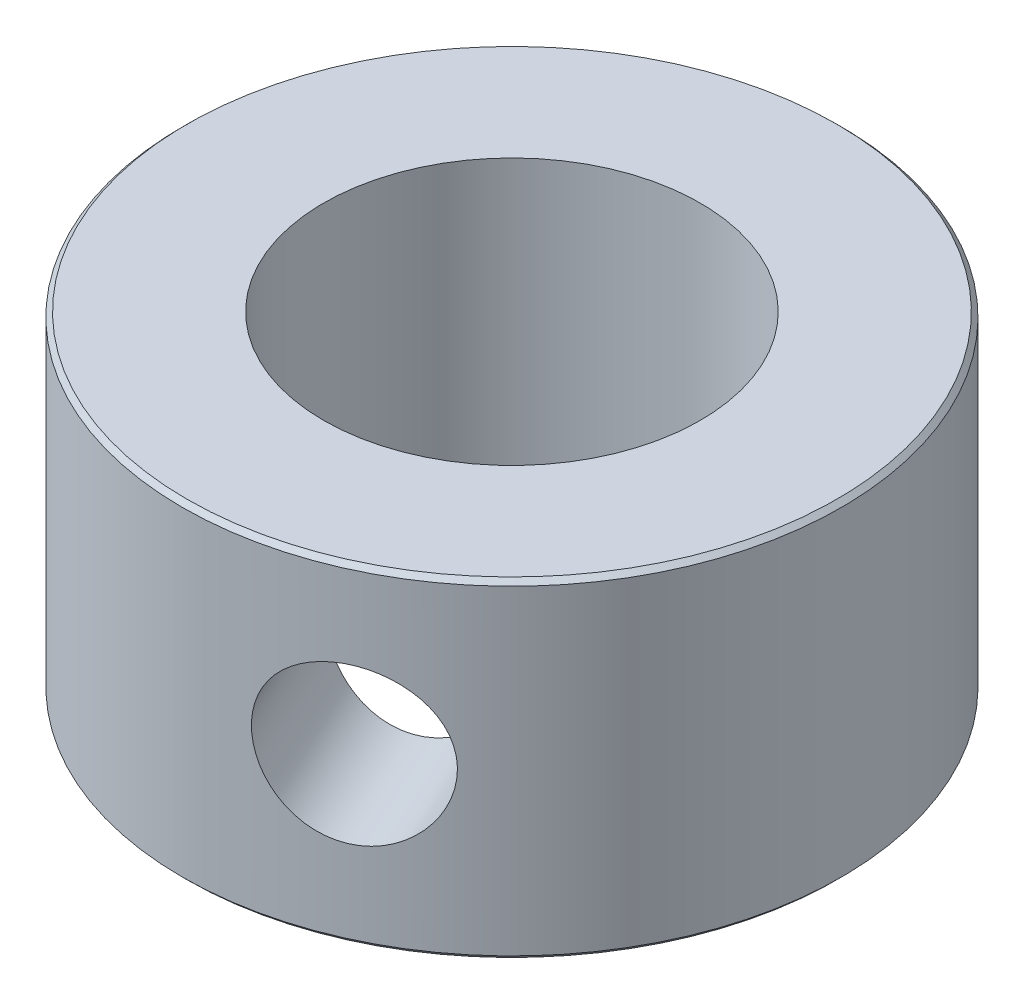
ISO-10303-21;
HEADER;
FILE_DESCRIPTION(('STEP AP214'),'2;1');
FILE_NAME('part.step','',(''),(''),'','','');
FILE_SCHEMA(('AUTOMOTIVE_DESIGN { 1 0 10303 214 1 1 1 1 }'));
ENDSEC;
DATA;
#1=APPLICATION_CONTEXT('core data for automotive mechanical design processes');
#2=APPLICATION_PROTOCOL_DEFINITION('international standard','automotive_design',2000,#1);
#3=PRODUCT_CONTEXT('',#1,'mechanical');
#4=PRODUCT('Part','Part','',(#3));
#5=PRODUCT_RELATED_PRODUCT_CATEGORY('part','',(#4));
#6=PRODUCT_DEFINITION_FORMATION('','',#4);
#7=PRODUCT_DEFINITION_CONTEXT('part definition',#1,'design');
#8=PRODUCT_DEFINITION('design','',#6,#7);
#9=PRODUCT_DEFINITION_SHAPE('','',#8);
#10=(LENGTH_UNIT() NAMED_UNIT(*) SI_UNIT(.MILLI.,.METRE.));
#11=(NAMED_UNIT(*) PLANE_ANGLE_UNIT() SI_UNIT($,.RADIAN.));
#12=(NAMED_UNIT(*) SI_UNIT($,.STERADIAN.) SOLID_ANGLE_UNIT());
#13=UNCERTAINTY_MEASURE_WITH_UNIT(LENGTH_MEASURE(1.E-05),#10,'distance_accuracy_value','');
#14=(GEOMETRIC_REPRESENTATION_CONTEXT(3) GLOBAL_UNCERTAINTY_ASSIGNED_CONTEXT((#13)) GLOBAL_UNIT_ASSIGNED_CONTEXT((#10,
#11,#12)) REPRESENTATION_CONTEXT('',''));
#15=CARTESIAN_POINT('',(0.,0.,0.));
#16=DIRECTION('',(0.,0.,1.));
#17=DIRECTION('',(1.,0.,0.));
#18=AXIS2_PLACEMENT_3D('',#15,#16,#17);
#19=CARTESIAN_POINT('',(0.,7.,0.));
#20=DIRECTION('',(0.,1.,0.));
#21=DIRECTION('',(0.,0.,1.));
#22=AXIS2_PLACEMENT_3D('',#19,#20,#21);
#23=PLANE('',#22);
#24=CARTESIAN_POINT('',(0.,7.,0.));
#25=DIRECTION('',(0.,1.,0.));
#26=DIRECTION('',(0.,0.,1.));
#27=AXIS2_PLACEMENT_3D('',#24,#25,#26);
#28=CIRCLE('',#27,6.9);
#29=CARTESIAN_POINT('',(0.,7.,6.9));
#30=VERTEX_POINT('',#29);
#31=EDGE_CURVE('E10',#30,#30,#28,.T.);
#32=ORIENTED_EDGE('',*,*,#31,.T.);
#33=EDGE_LOOP('',(#32));
#34=FACE_BOUND('',#33,.T.);
#35=CARTESIAN_POINT('',(0.,7.,0.));
#36=DIRECTION('',(0.,1.,0.));
#37=DIRECTION('',(0.,0.,1.));
#38=AXIS2_PLACEMENT_3D('',#35,#36,#37);
#39=CIRCLE('',#38,4.);
#40=CARTESIAN_POINT('',(0.,7.,4.));
#41=VERTEX_POINT('',#40);
#42=EDGE_CURVE('E78',#41,#41,#39,.T.);
#43=ORIENTED_EDGE('',*,*,#42,.F.);
#44=EDGE_LOOP('',(#43));
#45=FACE_BOUND('',#44,.T.);
#46=ADVANCED_FACE('F45',(#34,#45),#23,.T.);
#47=CARTESIAN_POINT('',(0.,0.,0.));
#48=DIRECTION('',(0.,1.,0.));
#49=DIRECTION('',(0.,0.,1.));
#50=AXIS2_PLACEMENT_3D('',#47,#48,#49);
#51=PLANE('',#50);
#52=CARTESIAN_POINT('',(0.,0.,0.));
#53=DIRECTION('',(0.,1.,0.));
#54=DIRECTION('',(0.,0.,1.));
#55=AXIS2_PLACEMENT_3D('',#52,#53,#54);
#56=CIRCLE('',#55,6.9);
#57=CARTESIAN_POINT('',(0.,0.,6.9));
#58=VERTEX_POINT('',#57);
#59=EDGE_CURVE('E53',#58,#58,#56,.F.);
#60=ORIENTED_EDGE('',*,*,#59,.T.);
#61=EDGE_LOOP('',(#60));
#62=FACE_BOUND('',#61,.T.);
#63=CARTESIAN_POINT('',(0.,0.,0.));
#64=DIRECTION('',(0.,1.,0.));
#65=DIRECTION('',(0.,0.,1.));
#66=AXIS2_PLACEMENT_3D('',#63,#64,#65);
#67=CIRCLE('',#66,4.);
#68=CARTESIAN_POINT('',(0.,0.,4.));
#69=VERTEX_POINT('',#68);
#70=EDGE_CURVE('E79',#69,#69,#67,.T.);
#71=ORIENTED_EDGE('',*,*,#70,.T.);
#72=EDGE_LOOP('',(#71));
#73=FACE_BOUND('',#72,.T.);
#74=ADVANCED_FACE('F109',(#62,#73),#51,.F.);
#75=CARTESIAN_POINT('',(0.,7.,0.));
#76=DIRECTION('',(0.,-1.,0.));
#77=DIRECTION('',(0.,0.,-1.));
#78=AXIS2_PLACEMENT_3D('',#75,#76,#77);
#79=CYLINDRICAL_SURFACE('',#78,7.);
#80=CARTESIAN_POINT('',(0.,0.1,0.));
#81=DIRECTION('',(0.,1.,0.));
#82=DIRECTION('',(0.,0.,1.));
#83=AXIS2_PLACEMENT_3D('',#80,#81,#82);
#84=CIRCLE('',#83,7.);
#85=CARTESIAN_POINT('',(0.,0.1,7.));
#86=VERTEX_POINT('',#85);
#87=EDGE_CURVE('E58',#86,#86,#84,.T.);
#88=ORIENTED_EDGE('',*,*,#87,.T.);
#89=EDGE_LOOP('',(#88));
#90=FACE_BOUND('',#89,.T.);
#91=CARTESIAN_POINT('',(0.,6.9,0.));
#92=DIRECTION('',(0.,1.,0.));
#93=DIRECTION('',(0.,0.,1.));
#94=AXIS2_PLACEMENT_3D('',#91,#92,#93);
#95=CIRCLE('',#94,7.);
#96=CARTESIAN_POINT('',(0.,6.9,7.));
#97=VERTEX_POINT('',#96);
#98=EDGE_CURVE('E63',#97,#97,#95,.F.);
#99=ORIENTED_EDGE('',*,*,#98,.T.);
#100=EDGE_LOOP('',(#99));
#101=FACE_BOUND('',#100,.T.);
#102=CARTESIAN_POINT('',(4.33695475854196,3.5,5.49461767754229));
#103=CARTESIAN_POINT('',(4.33695290809923,3.40871099997652,5.49462052617283));
#104=CARTESIAN_POINT('',(4.3308204478108,3.31738900161891,5.49947661884195));
#105=CARTESIAN_POINT('',(4.30642007110906,3.13735543656597,5.51860289653467));
#106=CARTESIAN_POINT('',(4.28814428934161,3.04864560071145,5.53287918307316));
#107=CARTESIAN_POINT('',(4.23988238827224,2.87646648747663,5.56994752920899));
#108=CARTESIAN_POINT('',(4.20991030824941,2.79299106604051,5.5927293780118));
#109=CARTESIAN_POINT('',(4.13886227276357,2.63338346720996,5.6455087575473));
#110=CARTESIAN_POINT('',(4.09778617216883,2.55725138581207,5.67550638259104));
#111=CARTESIAN_POINT('',(4.00448567264662,2.41300017131406,5.74172584098752));
#112=CARTESIAN_POINT('',(3.95207750988321,2.34504595472282,5.77804807616412));
#113=CARTESIAN_POINT('',(3.83756477380056,2.22052828829884,5.85472773588049));
#114=CARTESIAN_POINT('',(3.77545936948574,2.16396581562249,5.8950855061348));
#115=CARTESIAN_POINT('',(3.64198656861028,2.06317303018274,5.97847741494681));
#116=CARTESIAN_POINT('',(3.57051454492172,2.01910313876716,6.02153838899059));
#117=CARTESIAN_POINT('',(3.42057086009637,1.94558709172224,6.10795974013822));
#118=CARTESIAN_POINT('',(3.34210011561603,1.91613902430984,6.1513200773487));
#119=CARTESIAN_POINT('',(3.18166938286995,1.87322629782889,6.2357875098592));
#120=CARTESIAN_POINT('',(3.09979824945055,1.85948200603305,6.27692118266486));
#121=CARTESIAN_POINT('',(2.93356847400079,1.84749086323874,6.35630825329692));
#122=CARTESIAN_POINT('',(2.84921016192308,1.84924196573697,6.39456203080304));
#123=CARTESIAN_POINT('',(2.68219217534081,1.86798740501017,6.46637071990166));
#124=CARTESIAN_POINT('',(2.59953184601341,1.88468011500454,6.50000348980106));
#125=CARTESIAN_POINT('',(2.4366723032739,1.93235207443574,6.56279283289124));
#126=CARTESIAN_POINT('',(2.35647321238835,1.96333203390087,6.59194918352302));
#127=CARTESIAN_POINT('',(2.20026957556281,2.03895377039328,6.6457279442721));
#128=CARTESIAN_POINT('',(2.12430510224419,2.08370617046967,6.67031095667816));
#129=CARTESIAN_POINT('',(1.97956239020466,2.185519225885,6.71469078440217));
#130=CARTESIAN_POINT('',(1.91078527806698,2.24258180650105,6.73448685002701));
#131=CARTESIAN_POINT('',(1.7809711301695,2.36902452509401,6.76999157550689));
#132=CARTESIAN_POINT('',(1.72016071769164,2.43866849569449,6.78559016682727));
#133=CARTESIAN_POINT('',(1.61032671076822,2.5874443211498,6.81249254702226));
#134=CARTESIAN_POINT('',(1.56130354929443,2.66657652436841,6.82379617814235));
#135=CARTESIAN_POINT('',(1.47666330208507,2.83253525980706,6.84261364703833));
#136=CARTESIAN_POINT('',(1.44109924109201,2.91939059395085,6.85011253398433));
#137=CARTESIAN_POINT('',(1.38508822355287,3.09806127756916,6.86165848349057));
#138=CARTESIAN_POINT('',(1.36463843423409,3.18987569413077,6.86570619290513));
#139=CARTESIAN_POINT('',(1.34002741741275,3.37353855694924,6.87055176369806));
#140=CARTESIAN_POINT('',(1.33549350857823,3.46533515973006,6.87142399940529));
#141=CARTESIAN_POINT('',(1.34186731452449,3.64836457658374,6.87018213154625));
#142=CARTESIAN_POINT('',(1.35277378107572,3.73959743563189,6.86806826938189));
#143=CARTESIAN_POINT('',(1.38929825352498,3.91757745074746,6.86077149304204));
#144=CARTESIAN_POINT('',(1.41470564674566,4.00436984565374,6.85563248349688));
#145=CARTESIAN_POINT('',(1.47907488594476,4.17249368663451,6.8420328006842));
#146=CARTESIAN_POINT('',(1.51803819629995,4.25382454159378,6.83357176854278));
#147=CARTESIAN_POINT('',(1.6089117198084,4.41029905658938,6.81275318003319));
#148=CARTESIAN_POINT('',(1.66103829699158,4.48530818474253,6.80032948918988));
#149=CARTESIAN_POINT('',(1.7760975232139,4.62557800629822,6.7711883829357));
#150=CARTESIAN_POINT('',(1.8390317422003,4.69083728083161,6.75447034354099));
#151=CARTESIAN_POINT('',(1.97518588680678,4.81122298204254,6.71593224186882));
#152=CARTESIAN_POINT('',(2.04860137475439,4.86609535547159,6.69400817940542));
#153=CARTESIAN_POINT('',(2.20227224150703,4.9623180167779,6.64503502097462));
#154=CARTESIAN_POINT('',(2.2825272771498,5.00366898256504,6.61798618205064));
#155=CARTESIAN_POINT('',(2.4467542621969,5.0713378389333,6.55903535520843));
#156=CARTESIAN_POINT('',(2.53069634784018,5.0977586745676,6.52716857053034));
#157=CARTESIAN_POINT('',(2.70016326638837,5.13513286894145,6.45890503545275));
#158=CARTESIAN_POINT('',(2.7856878272703,5.14608886147333,6.42250905756199));
#159=CARTESIAN_POINT('',(2.95361249294322,5.15208813057132,6.34700294170077));
#160=CARTESIAN_POINT('',(3.03603823759707,5.14750832426095,6.30797929141249));
#161=CARTESIAN_POINT('',(3.19753347433021,5.12341975270526,6.22767321304482));
#162=CARTESIAN_POINT('',(3.27660304663566,5.10391134452658,6.18639083901215));
#163=CARTESIAN_POINT('',(3.42899022222941,5.05071176108927,6.10323970829406));
#164=CARTESIAN_POINT('',(3.50233107509893,5.01708187051131,6.06137423230331));
#165=CARTESIAN_POINT('',(3.64194798969843,4.9366509910792,5.97852928259634));
#166=CARTESIAN_POINT('',(3.7082232512061,4.88984851252764,5.93754990965491));
#167=CARTESIAN_POINT('',(3.83368684312346,4.78321390355334,5.85734707854002));
#168=CARTESIAN_POINT('',(3.89269059682572,4.72312153020512,5.81818087222184));
#169=CARTESIAN_POINT('',(4.000747446629,4.59212760248887,5.74441554290829));
#170=CARTESIAN_POINT('',(4.04979808207846,4.52122338274089,5.70981755002243));
#171=CARTESIAN_POINT('',(4.13770229302743,4.36924540614473,5.64645114230857));
#172=CARTESIAN_POINT('',(4.17637911535602,4.2880263885213,5.61778547287829));
#173=CARTESIAN_POINT('',(4.2416620994615,4.11860266624687,5.56866088592655));
#174=CARTESIAN_POINT('',(4.26827773329602,4.03040350750556,5.54819552989044));
#175=CARTESIAN_POINT('',(4.30463016708739,3.86853084559052,5.52001492462501));
#176=CARTESIAN_POINT('',(4.31673458241366,3.79568399515568,5.5105270007543));
#177=CARTESIAN_POINT('',(4.3328973646978,3.64856531846772,5.49782742587969));
#178=CARTESIAN_POINT('',(4.33695626448493,3.57429358690895,5.49461535924566));
#179=CARTESIAN_POINT('',(4.33695475854196,3.5,5.49461767754229));
#180=B_SPLINE_CURVE_WITH_KNOTS('',3,(#102,#103,#104,#105,#106,#107,#108,#109,#110,#111,#112,
#113,#114,#115,#116,#117,#118,#119,#120,#121,#122,#123,#124,#125,#126,#127,#128,#129,#130,#131,
#132,#133,#134,#135,#136,#137,#138,#139,#140,#141,#142,#143,#144,#145,#146,#147,#148,#149,#150,
#151,#152,#153,#154,#155,#156,#157,#158,#159,#160,#161,#162,#163,#164,#165,#166,#167,#168,#169,
#170,#171,#172,#173,#174,#175,#176,#177,#178,#179),.UNSPECIFIED.,.T.,.F.,(4,2,2,2,2,2,2,2,2,2,2,
2,2,2,2,2,2,2,2,2,2,2,2,2,2,2,2,2,2,2,2,2,2,2,2,2,2,2,4),(0.,0.273594440399257,
0.547366263700772,0.820810479503742,1.0942582694491,1.37252656286892,1.65081871531697,
1.93253747960749,2.21421939985747,2.49080324523181,2.76735056224875,3.03843805884696,
3.30953902903523,3.58287702808519,3.85625780745002,4.13623055025585,4.41621357550837,
4.69728844125183,4.97831061353601,5.25270687968442,5.52708096437944,5.79756789407087,
6.06808405216621,6.34337456664895,6.61870510445456,6.90008328124661,7.18144734868651,
7.46084693391314,7.74019892930649,8.0128224633276,8.28543947686363,8.55688541369865,
8.82836206089263,9.10571835709366,9.38314313916055,9.66503130549492,9.94669771026967,
10.1693714016501,10.3920303455577),.UNSPECIFIED.);
#181=CARTESIAN_POINT('',(4.33695475854196,3.5,5.49461767754229));
#182=VERTEX_POINT('',#181);
#183=EDGE_CURVE('E69',#182,#182,#180,.T.);
#184=ORIENTED_EDGE('',*,*,#183,.T.);
#185=EDGE_LOOP('',(#184));
#186=FACE_BOUND('',#185,.T.);
#187=ADVANCED_FACE('F81',(#90,#101,#186),#79,.T.);
#188=CARTESIAN_POINT('',(0.,7.,0.));
#189=DIRECTION('',(0.,-1.,0.));
#190=DIRECTION('',(0.,0.,-1.));
#191=AXIS2_PLACEMENT_3D('',#188,#189,#190);
#192=CYLINDRICAL_SURFACE('',#191,4.);
#193=CARTESIAN_POINT('',(3.01941624706044,3.5,2.62357114006605));
#194=CARTESIAN_POINT('',(3.01941144958077,3.41190351977432,2.62358329970489));
#195=CARTESIAN_POINT('',(3.01431509514671,3.32365956802641,2.62947842448701));
#196=CARTESIAN_POINT('',(2.99400573734745,3.14971293892112,2.65257427169993));
#197=CARTESIAN_POINT('',(2.97876501178491,3.0640178994024,2.66980597284604));
#198=CARTESIAN_POINT('',(2.93851283218737,2.89799706186937,2.71404237086341));
#199=CARTESIAN_POINT('',(2.91354065893688,2.8176511797814,2.74100774611007));
#200=CARTESIAN_POINT('',(2.8541662469186,2.66381823316578,2.80277769895583));
#201=CARTESIAN_POINT('',(2.81976636963666,2.59032945721597,2.83758031306585));
#202=CARTESIAN_POINT('',(2.73968469007096,2.4477713121535,2.91502885177799));
#203=CARTESIAN_POINT('',(2.69348439036254,2.3791707442198,2.95800197769271));
#204=CARTESIAN_POINT('',(2.59129959116768,2.25264522809124,3.04791662533316));
#205=CARTESIAN_POINT('',(2.53531137854823,2.19472434852778,3.09485964957403));
#206=CARTESIAN_POINT('',(2.41153898349142,2.08882862869814,3.19232424498335));
#207=CARTESIAN_POINT('',(2.34335557156882,2.04137906729385,3.24291316937387));
#208=CARTESIAN_POINT('',(2.19809677930497,1.9613298546783,3.3430727523345));
#209=CARTESIAN_POINT('',(2.12102529019716,1.92872373565344,3.39264384540126));
#210=CARTESIAN_POINT('',(1.96395594854863,1.88097929334378,3.4857972032843));
#211=CARTESIAN_POINT('',(1.88430915443039,1.86503315207677,3.52955607983508));
#212=CARTESIAN_POINT('',(1.72092940034066,1.84845334814483,3.61203022665663));
#213=CARTESIAN_POINT('',(1.63719807628572,1.84781360467799,3.65074749373731));
#214=CARTESIAN_POINT('',(1.47342329485833,1.8614364961366,3.71973844079712));
#215=CARTESIAN_POINT('',(1.3934579087069,1.8748121837171,3.75037809650607));
#216=CARTESIAN_POINT('',(1.23469092699598,1.91456881744776,3.80560189940168));
#217=CARTESIAN_POINT('',(1.15588941757692,1.94095072129068,3.83018560046747));
#218=CARTESIAN_POINT('',(1.00054395659582,2.00628766172018,3.87369632885558));
#219=CARTESIAN_POINT('',(0.924052635079114,2.04542798992487,3.89253154513523));
#220=CARTESIAN_POINT('',(0.776708004766597,2.13499127918661,3.92459153514696));
#221=CARTESIAN_POINT('',(0.705856686803698,2.18541820050331,3.93781433485606));
#222=CARTESIAN_POINT('',(0.567057563411857,2.30018823902864,3.96026845059458));
#223=CARTESIAN_POINT('',(0.499650934972131,2.36525341089873,3.96915979139928));
#224=CARTESIAN_POINT('',(0.375664111898481,2.50540966632158,3.98281000091138));
#225=CARTESIAN_POINT('',(0.319087930865847,2.5805044492633,3.98756733992239));
#226=CARTESIAN_POINT('',(0.217368093715309,2.74159840354732,3.99442601686795));
#227=CARTESIAN_POINT('',(0.172643187580061,2.82786757169265,3.99643848016928));
#228=CARTESIAN_POINT('',(0.0994067467926932,3.0070466714059,3.99893448422425));
#229=CARTESIAN_POINT('',(0.0708838887714532,3.09995191387382,3.99941909385245));
#230=CARTESIAN_POINT('',(0.0331008736343943,3.28342289518499,3.99990514662907));
#231=CARTESIAN_POINT('',(0.0227255162537152,3.37375830118286,3.99993550635091));
#232=CARTESIAN_POINT('',(0.0184282212574857,3.5548056296986,3.99995864089472));
#233=CARTESIAN_POINT('',(0.0245007771913549,3.64551741605928,3.99995142829444));
#234=CARTESIAN_POINT('',(0.0517991046420298,3.81880100904947,3.99968485991811));
#235=CARTESIAN_POINT('',(0.0720588860163648,3.90152817967461,3.99944121481733));
#236=CARTESIAN_POINT('',(0.125602117446577,4.06263706437997,3.99811654573303));
#237=CARTESIAN_POINT('',(0.158888571604349,4.14101777135166,3.9970353285393));
#238=CARTESIAN_POINT('',(0.238661955773673,4.29487900569563,3.99308079603675));
#239=CARTESIAN_POINT('',(0.285643783825149,4.37010019477924,3.99013425141886));
#240=CARTESIAN_POINT('',(0.3903577959711,4.51246016942973,3.98125344843018));
#241=CARTESIAN_POINT('',(0.448094565004334,4.57959548773512,3.97531791397801));
#242=CARTESIAN_POINT('',(0.577450979951415,4.70942962644671,3.95867729484451));
#243=CARTESIAN_POINT('',(0.64980930919276,4.77135173704872,3.9476306219003));
#244=CARTESIAN_POINT('',(0.802573341518197,4.88264285566206,3.91942630144447));
#245=CARTESIAN_POINT('',(0.882979564468714,4.93201105200319,3.90226825897586));
#246=CARTESIAN_POINT('',(1.04941434461576,5.01670413420678,3.86084025305739));
#247=CARTESIAN_POINT('',(1.13545280167505,5.05200347500272,3.8365574906217));
#248=CARTESIAN_POINT('',(1.31003334584918,5.10699165685874,3.78050214733575));
#249=CARTESIAN_POINT('',(1.398573944757,5.12668958293893,3.74873393941821));
#250=CARTESIAN_POINT('',(1.56888720219553,5.14878822892048,3.68054703677282));
#251=CARTESIAN_POINT('',(1.65070673787635,5.15228482874193,3.64459809409667));
#252=CARTESIAN_POINT('',(1.81119355726589,5.14481456562971,3.56756152339347));
#253=CARTESIAN_POINT('',(1.88986137203446,5.13385015000454,3.52647476592908));
#254=CARTESIAN_POINT('',(2.03922736006769,5.09855535786443,3.44218865379296));
#255=CARTESIAN_POINT('',(2.11010619856965,5.07469555788544,3.39910982863023));
#256=CARTESIAN_POINT('',(2.24538782394219,5.01479588512,3.3113053465099));
#257=CARTESIAN_POINT('',(2.30978936510477,4.97875367521331,3.26657937502556));
#258=CARTESIAN_POINT('',(2.43383660550365,4.89369547331361,3.17531665307993));
#259=CARTESIAN_POINT('',(2.49313798351049,4.84416874322707,3.12878896567008));
#260=CARTESIAN_POINT('',(2.60288153578027,4.73429715321,3.03810531475052));
#261=CARTESIAN_POINT('',(2.65332048971896,4.67394837691919,2.99395021739394));
#262=CARTESIAN_POINT('',(2.74794838114443,4.53941247264534,2.9074319849312));
#263=CARTESIAN_POINT('',(2.79149924372872,4.46457224311506,2.86538292246717));
#264=CARTESIAN_POINT('',(2.86762823897244,4.30573402431893,2.78919718326957));
#265=CARTESIAN_POINT('',(2.9002003081141,4.22173100829041,2.75506488214751));
#266=CARTESIAN_POINT('',(2.95374384708205,4.0472715587301,2.69758014399135));
#267=CARTESIAN_POINT('',(2.97478974493348,3.9568608919089,2.67415870975631));
#268=CARTESIAN_POINT('',(3.00514453401902,3.77195285592164,2.64000969722858));
#269=CARTESIAN_POINT('',(3.0144927977101,3.67747030912313,2.62923954418869));
#270=CARTESIAN_POINT('',(3.01892038614256,3.55513668635736,2.62413993321346));
#271=CARTESIAN_POINT('',(3.01941774874615,3.52757556771498,2.62356733391008));
#272=CARTESIAN_POINT('',(3.01941624706044,3.5,2.62357114006605));
#273=B_SPLINE_CURVE_WITH_KNOTS('',3,(#193,#194,#195,#196,#197,#198,#199,#200,#201,#202,#203,
#204,#205,#206,#207,#208,#209,#210,#211,#212,#213,#214,#215,#216,#217,#218,#219,#220,#221,#222,
#223,#224,#225,#226,#227,#228,#229,#230,#231,#232,#233,#234,#235,#236,#237,#238,#239,#240,#241,
#242,#243,#244,#245,#246,#247,#248,#249,#250,#251,#252,#253,#254,#255,#256,#257,#258,#259,#260,
#261,#262,#263,#264,#265,#266,#267,#268,#269,#270,#271,#272),.UNSPECIFIED.,.T.,.F.,(4,2,2,2,2,2,
2,2,2,2,2,2,2,2,2,2,2,2,2,2,2,2,2,2,2,2,2,2,2,2,2,2,2,2,2,2,2,2,2,4),(0.,0.264211724660743,
0.529148459018596,0.793026677872046,1.05683885985755,1.33523297260791,1.61373292676209,
1.90403076094908,2.19420198072698,2.46953816244269,2.74476495901023,3.00356896819765,
3.2623920368679,3.52515526924739,3.78801084539544,4.06907613148063,4.35024537535723,
4.64031806272422,4.93018777241109,5.20152035698262,5.47276211576041,5.72713321026164,
5.98156300028879,6.24665916965706,6.51186861189121,6.79815687284344,7.08446363898861,
7.37128791456168,7.65794504349148,7.92489841526077,8.19180661499932,8.44957452423756,
8.70739191275385,8.97680852354692,9.24632283025304,9.53374725602172,9.82133016535513,
10.1070334851925,10.3917725616093,10.4744749384331),.UNSPECIFIED.);
#274=CARTESIAN_POINT('',(3.01941624706044,3.5,2.62357114006605));
#275=VERTEX_POINT('',#274);
#276=EDGE_CURVE('E95',#275,#275,#273,.T.);
#277=ORIENTED_EDGE('',*,*,#276,.F.);
#278=EDGE_LOOP('',(#277));
#279=FACE_BOUND('',#278,.T.);
#280=ORIENTED_EDGE('',*,*,#42,.T.);
#281=EDGE_LOOP('',(#280));
#282=FACE_BOUND('',#281,.T.);
#283=ORIENTED_EDGE('',*,*,#70,.F.);
#284=EDGE_LOOP('',(#283));
#285=FACE_BOUND('',#284,.T.);
#286=ADVANCED_FACE('F89',(#279,#282,#285),#192,.F.);
#287=CARTESIAN_POINT('',(2.91958989736213,3.5,6.36207472694411));
#288=DIRECTION('',(0.417084271051733,0.,0.908867818134873));
#289=DIRECTION('',(0.908867818134873,0.,-0.417084271051734));
#290=AXIS2_PLACEMENT_3D('',#287,#288,#289);
#291=CYLINDRICAL_SURFACE('',#290,1.64999999999999);
#292=ORIENTED_EDGE('',*,*,#276,.T.);
#293=EDGE_LOOP('',(#292));
#294=FACE_BOUND('',#293,.T.);
#295=ORIENTED_EDGE('',*,*,#183,.F.);
#296=EDGE_LOOP('',(#295));
#297=FACE_BOUND('',#296,.T.);
#298=ADVANCED_FACE('F84',(#294,#297),#291,.F.);
#299=CARTESIAN_POINT('',(0.,0.1,0.));
#300=DIRECTION('',(0.,1.,0.));
#301=DIRECTION('',(0.,0.,1.));
#302=AXIS2_PLACEMENT_3D('',#299,#300,#301);
#303=CONICAL_SURFACE('',#302,7.,0.785398163397457);
#304=ORIENTED_EDGE('',*,*,#59,.F.);
#305=EDGE_LOOP('',(#304));
#306=FACE_BOUND('',#305,.T.);
#307=ORIENTED_EDGE('',*,*,#87,.F.);
#308=EDGE_LOOP('',(#307));
#309=FACE_BOUND('',#308,.T.);
#310=ADVANCED_FACE('F88',(#306,#309),#303,.T.);
#311=CARTESIAN_POINT('',(0.,7.,0.));
#312=DIRECTION('',(0.,-1.,0.));
#313=DIRECTION('',(0.,0.,-1.));
#314=AXIS2_PLACEMENT_3D('',#311,#312,#313);
#315=CONICAL_SURFACE('',#314,6.9,0.785398163397466);
#316=ORIENTED_EDGE('',*,*,#98,.F.);
#317=EDGE_LOOP('',(#316));
#318=FACE_BOUND('',#317,.T.);
#319=ORIENTED_EDGE('',*,*,#31,.F.);
#320=EDGE_LOOP('',(#319));
#321=FACE_BOUND('',#320,.T.);
#322=ADVANCED_FACE('F47',(#318,#321),#315,.T.);
#323=CLOSED_SHELL('',(#46,#74,#187,#286,#298,#310,#322));
#324=MANIFOLD_SOLID_BREP('B2',#323);
#325=ADVANCED_BREP_SHAPE_REPRESENTATION('',(#18,#324),#14);
#326=SHAPE_DEFINITION_REPRESENTATION(#9,#325);
ENDSEC;
END-ISO-10303-21;
